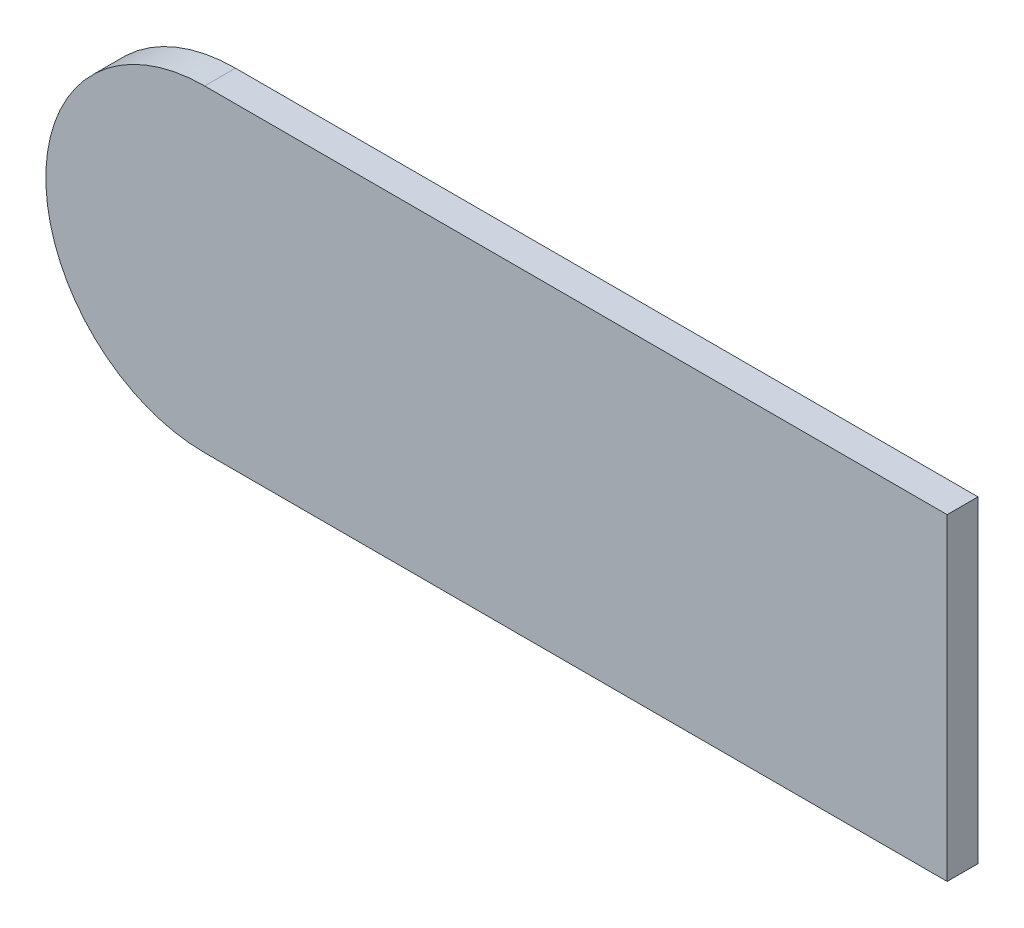
ISO-10303-21;
HEADER;
FILE_DESCRIPTION(('STEP AP214'),'2;1');
FILE_NAME('part.step','',(''),(''),'','','');
FILE_SCHEMA(('AUTOMOTIVE_DESIGN { 1 0 10303 214 1 1 1 1 }'));
ENDSEC;
DATA;
#1=APPLICATION_CONTEXT('core data for automotive mechanical design processes');
#2=APPLICATION_PROTOCOL_DEFINITION('international standard','automotive_design',2000,#1);
#3=PRODUCT_CONTEXT('',#1,'mechanical');
#4=PRODUCT('Part','Part','',(#3));
#5=PRODUCT_RELATED_PRODUCT_CATEGORY('part','',(#4));
#6=PRODUCT_DEFINITION_FORMATION('','',#4);
#7=PRODUCT_DEFINITION_CONTEXT('part definition',#1,'design');
#8=PRODUCT_DEFINITION('design','',#6,#7);
#9=PRODUCT_DEFINITION_SHAPE('','',#8);
#10=(LENGTH_UNIT() NAMED_UNIT(*) SI_UNIT(.MILLI.,.METRE.));
#11=(NAMED_UNIT(*) PLANE_ANGLE_UNIT() SI_UNIT($,.RADIAN.));
#12=(NAMED_UNIT(*) SI_UNIT($,.STERADIAN.) SOLID_ANGLE_UNIT());
#13=UNCERTAINTY_MEASURE_WITH_UNIT(LENGTH_MEASURE(1.E-05),#10,'distance_accuracy_value','');
#14=(GEOMETRIC_REPRESENTATION_CONTEXT(3) GLOBAL_UNCERTAINTY_ASSIGNED_CONTEXT((#13)) GLOBAL_UNIT_ASSIGNED_CONTEXT((#10,
#11,#12)) REPRESENTATION_CONTEXT('',''));
#15=CARTESIAN_POINT('',(0.,0.,0.));
#16=DIRECTION('',(0.,0.,1.));
#17=DIRECTION('',(1.,0.,0.));
#18=AXIS2_PLACEMENT_3D('',#15,#16,#17);
#19=CARTESIAN_POINT('',(-12.3042138671329,-1.03740541843096,-11.6632275560423));
#20=DIRECTION('',(0.,0.,1.));
#21=DIRECTION('',(0.,-1.,0.));
#22=AXIS2_PLACEMENT_3D('',#19,#20,#21);
#23=PLANE('',#22);
#24=CARTESIAN_POINT('',(5.2384676511989,-5.66624989789698,-11.6632275560423));
#25=DIRECTION('',(0.,0.,1.));
#26=DIRECTION('',(0.,-1.,0.));
#27=AXIS2_PLACEMENT_3D('',#24,#25,#26);
#28=CIRCLE('',#27,0.267897163083286);
#29=CARTESIAN_POINT('',(5.2384676511989,-5.3983527348137,-11.6632275560423));
#30=VERTEX_POINT('',#29);
#31=CARTESIAN_POINT('',(5.2384676511989,-5.93414706098027,-11.6632275560423));
#32=VERTEX_POINT('',#31);
#33=EDGE_CURVE('E19',#30,#32,#28,.T.);
#34=ORIENTED_EDGE('',*,*,#33,.F.);
#35=DIRECTION('',(1.,0.,0.));
#36=VECTOR('',#35,1.);
#37=CARTESIAN_POINT('',(6.49085724435409,-5.3983527348137,-11.6632275560423));
#38=LINE('',#37,#36);
#39=CARTESIAN_POINT('',(6.49085724435409,-5.3983527348137,-11.6632275560423));
#40=VERTEX_POINT('',#39);
#41=EDGE_CURVE('E57',#40,#30,#38,.F.);
#42=ORIENTED_EDGE('',*,*,#41,.F.);
#43=DIRECTION('',(0.,1.,0.));
#44=VECTOR('',#43,1.);
#45=CARTESIAN_POINT('',(6.49085724435409,-5.93414706098027,-11.6632275560423));
#46=LINE('',#45,#44);
#47=CARTESIAN_POINT('',(6.49085724435409,-5.93414706098027,-11.6632275560423));
#48=VERTEX_POINT('',#47);
#49=EDGE_CURVE('E73',#48,#40,#46,.T.);
#50=ORIENTED_EDGE('',*,*,#49,.F.);
#51=DIRECTION('',(1.,0.,0.));
#52=VECTOR('',#51,1.);
#53=CARTESIAN_POINT('',(6.49085724435409,-5.93414706098027,-11.6632275560423));
#54=LINE('',#53,#52);
#55=EDGE_CURVE('E59',#32,#48,#54,.T.);
#56=ORIENTED_EDGE('',*,*,#55,.F.);
#57=EDGE_LOOP('',(#34,#42,#50,#56));
#58=FACE_BOUND('',#57,.T.);
#59=ADVANCED_FACE('F16',(#58),#23,.F.);
#60=CARTESIAN_POINT('',(5.2384676511989,-5.66624989789698,-11.6112275560423));
#61=DIRECTION('',(0.,0.,1.));
#62=DIRECTION('',(0.,-1.,0.));
#63=AXIS2_PLACEMENT_3D('',#60,#61,#62);
#64=CYLINDRICAL_SURFACE('',#63,0.267897163083286);
#65=ORIENTED_EDGE('',*,*,#33,.T.);
#66=DIRECTION('',(0.,0.,1.));
#67=VECTOR('',#66,1.);
#68=CARTESIAN_POINT('',(5.2384676511989,-5.93414706098027,-11.6112275560423));
#69=LINE('',#68,#67);
#70=CARTESIAN_POINT('',(5.2384676511989,-5.93414706098027,-11.6112275560423));
#71=VERTEX_POINT('',#70);
#72=EDGE_CURVE('E82',#71,#32,#69,.F.);
#73=ORIENTED_EDGE('',*,*,#72,.F.);
#74=CARTESIAN_POINT('',(5.2384676511989,-5.66624989789698,-11.6112275560423));
#75=DIRECTION('',(0.,0.,1.));
#76=DIRECTION('',(0.,-1.,0.));
#77=AXIS2_PLACEMENT_3D('',#74,#75,#76);
#78=CIRCLE('',#77,0.267897163083286);
#79=CARTESIAN_POINT('',(5.2384676511989,-5.3983527348137,-11.6112275560423));
#80=VERTEX_POINT('',#79);
#81=EDGE_CURVE('E66',#80,#71,#78,.T.);
#82=ORIENTED_EDGE('',*,*,#81,.F.);
#83=DIRECTION('',(0.,0.,1.));
#84=VECTOR('',#83,1.);
#85=CARTESIAN_POINT('',(5.2384676511989,-5.3983527348137,-11.6112275560423));
#86=LINE('',#85,#84);
#87=EDGE_CURVE('E63',#30,#80,#86,.T.);
#88=ORIENTED_EDGE('',*,*,#87,.F.);
#89=EDGE_LOOP('',(#65,#73,#82,#88));
#90=FACE_BOUND('',#89,.T.);
#91=ADVANCED_FACE('F64',(#90),#64,.T.);
#92=CARTESIAN_POINT('',(6.49085724435409,-5.93414706098027,-11.6112275560423));
#93=DIRECTION('',(0.,-1.,0.));
#94=DIRECTION('',(1.,0.,0.));
#95=AXIS2_PLACEMENT_3D('',#92,#93,#94);
#96=PLANE('',#95);
#97=DIRECTION('',(1.,0.,0.));
#98=VECTOR('',#97,1.);
#99=CARTESIAN_POINT('',(-12.3042138671329,-5.93414706098027,-11.6112275560423));
#100=LINE('',#99,#98);
#101=CARTESIAN_POINT('',(6.49085724435409,-5.93414706098027,-11.6112275560423));
#102=VERTEX_POINT('',#101);
#103=EDGE_CURVE('E84',#71,#102,#100,.T.);
#104=ORIENTED_EDGE('',*,*,#103,.F.);
#105=ORIENTED_EDGE('',*,*,#72,.T.);
#106=ORIENTED_EDGE('',*,*,#55,.T.);
#107=DIRECTION('',(0.,0.,1.));
#108=VECTOR('',#107,1.);
#109=CARTESIAN_POINT('',(6.49085724435409,-5.93414706098027,-11.6112275560423));
#110=LINE('',#109,#108);
#111=EDGE_CURVE('E70',#102,#48,#110,.F.);
#112=ORIENTED_EDGE('',*,*,#111,.F.);
#113=EDGE_LOOP('',(#104,#105,#106,#112));
#114=FACE_BOUND('',#113,.T.);
#115=ADVANCED_FACE('F102',(#114),#96,.T.);
#116=CARTESIAN_POINT('',(6.49085724435409,-5.93414706098027,-11.6112275560423));
#117=DIRECTION('',(1.,0.,0.));
#118=DIRECTION('',(0.,1.,0.));
#119=AXIS2_PLACEMENT_3D('',#116,#117,#118);
#120=PLANE('',#119);
#121=DIRECTION('',(0.,-1.,0.));
#122=VECTOR('',#121,1.);
#123=CARTESIAN_POINT('',(6.49085724435409,-1.03740541843096,-11.6112275560423));
#124=LINE('',#123,#122);
#125=CARTESIAN_POINT('',(6.49085724435409,-5.3983527348137,-11.6112275560423));
#126=VERTEX_POINT('',#125);
#127=EDGE_CURVE('E25',#102,#126,#124,.F.);
#128=ORIENTED_EDGE('',*,*,#127,.F.);
#129=ORIENTED_EDGE('',*,*,#111,.T.);
#130=ORIENTED_EDGE('',*,*,#49,.T.);
#131=DIRECTION('',(0.,0.,1.));
#132=VECTOR('',#131,1.);
#133=CARTESIAN_POINT('',(6.49085724435409,-5.3983527348137,-11.6112275560423));
#134=LINE('',#133,#132);
#135=EDGE_CURVE('E34',#126,#40,#134,.F.);
#136=ORIENTED_EDGE('',*,*,#135,.F.);
#137=EDGE_LOOP('',(#128,#129,#130,#136));
#138=FACE_BOUND('',#137,.T.);
#139=ADVANCED_FACE('F99',(#138),#120,.T.);
#140=CARTESIAN_POINT('',(6.49085724435409,-5.3983527348137,-11.6112275560423));
#141=DIRECTION('',(0.,1.,0.));
#142=DIRECTION('',(0.,0.,1.));
#143=AXIS2_PLACEMENT_3D('',#140,#141,#142);
#144=PLANE('',#143);
#145=DIRECTION('',(1.,0.,0.));
#146=VECTOR('',#145,1.);
#147=CARTESIAN_POINT('',(-12.3042138671329,-5.3983527348137,-11.6112275560423));
#148=LINE('',#147,#146);
#149=EDGE_CURVE('E11',#126,#80,#148,.F.);
#150=ORIENTED_EDGE('',*,*,#149,.F.);
#151=ORIENTED_EDGE('',*,*,#135,.T.);
#152=ORIENTED_EDGE('',*,*,#41,.T.);
#153=ORIENTED_EDGE('',*,*,#87,.T.);
#154=EDGE_LOOP('',(#150,#151,#152,#153));
#155=FACE_BOUND('',#154,.T.);
#156=ADVANCED_FACE('F69',(#155),#144,.T.);
#157=CARTESIAN_POINT('',(-12.3042138671329,-1.03740541843096,-11.6112275560423));
#158=DIRECTION('',(0.,0.,1.));
#159=DIRECTION('',(0.,-1.,0.));
#160=AXIS2_PLACEMENT_3D('',#157,#158,#159);
#161=PLANE('',#160);
#162=ORIENTED_EDGE('',*,*,#127,.T.);
#163=ORIENTED_EDGE('',*,*,#149,.T.);
#164=ORIENTED_EDGE('',*,*,#81,.T.);
#165=ORIENTED_EDGE('',*,*,#103,.T.);
#166=EDGE_LOOP('',(#162,#163,#164,#165));
#167=FACE_BOUND('',#166,.T.);
#168=ADVANCED_FACE('F103',(#167),#161,.T.);
#169=CLOSED_SHELL('',(#59,#91,#115,#139,#156,#168));
#170=MANIFOLD_SOLID_BREP('B1',#169);
#171=ADVANCED_BREP_SHAPE_REPRESENTATION('',(#18,#170),#14);
#172=SHAPE_DEFINITION_REPRESENTATION(#9,#171);
ENDSEC;
END-ISO-10303-21;
